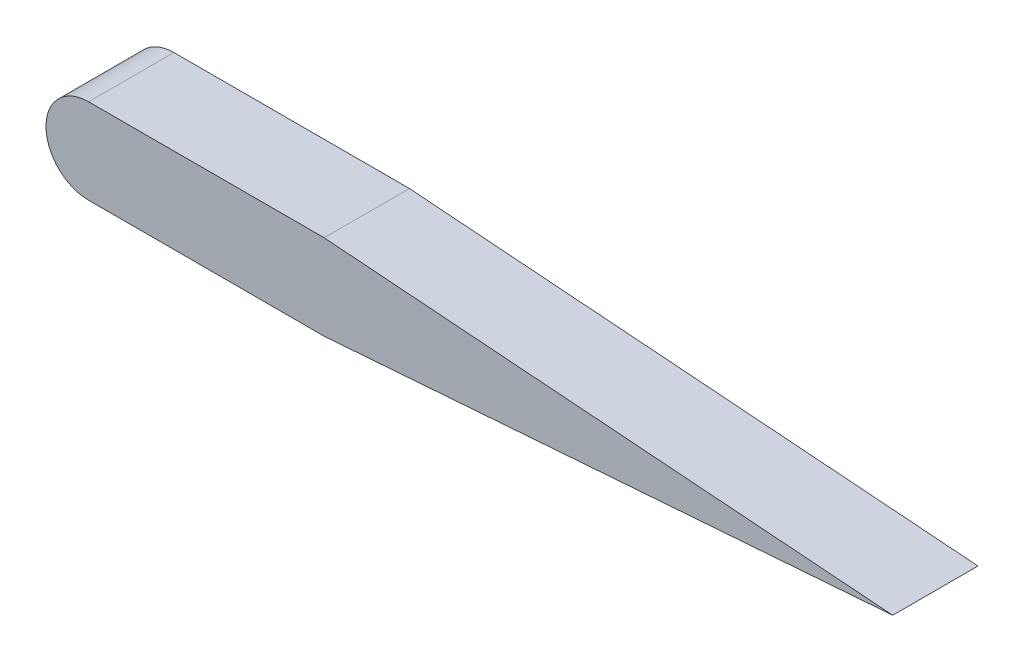
ISO-10303-21;
HEADER;
FILE_DESCRIPTION(('STEP AP214'),'2;1');
FILE_NAME('part.step','',(''),(''),'','','');
FILE_SCHEMA(('AUTOMOTIVE_DESIGN { 1 0 10303 214 1 1 1 1 }'));
ENDSEC;
DATA;
#1=APPLICATION_CONTEXT('core data for automotive mechanical design processes');
#2=APPLICATION_PROTOCOL_DEFINITION('international standard','automotive_design',2000,#1);
#3=PRODUCT_CONTEXT('',#1,'mechanical');
#4=PRODUCT('Part','Part','',(#3));
#5=PRODUCT_RELATED_PRODUCT_CATEGORY('part','',(#4));
#6=PRODUCT_DEFINITION_FORMATION('','',#4);
#7=PRODUCT_DEFINITION_CONTEXT('part definition',#1,'design');
#8=PRODUCT_DEFINITION('design','',#6,#7);
#9=PRODUCT_DEFINITION_SHAPE('','',#8);
#10=(LENGTH_UNIT() NAMED_UNIT(*) SI_UNIT(.MILLI.,.METRE.));
#11=(NAMED_UNIT(*) PLANE_ANGLE_UNIT() SI_UNIT($,.RADIAN.));
#12=(NAMED_UNIT(*) SI_UNIT($,.STERADIAN.) SOLID_ANGLE_UNIT());
#13=UNCERTAINTY_MEASURE_WITH_UNIT(LENGTH_MEASURE(1.E-05),#10,'distance_accuracy_value','');
#14=(GEOMETRIC_REPRESENTATION_CONTEXT(3) GLOBAL_UNCERTAINTY_ASSIGNED_CONTEXT((#13)) GLOBAL_UNIT_ASSIGNED_CONTEXT((#10,
#11,#12)) REPRESENTATION_CONTEXT('',''));
#15=CARTESIAN_POINT('',(0.,0.,0.));
#16=DIRECTION('',(0.,0.,1.));
#17=DIRECTION('',(1.,0.,0.));
#18=AXIS2_PLACEMENT_3D('',#15,#16,#17);
#19=CARTESIAN_POINT('',(0.,1.5875,3.175));
#20=DIRECTION('',(0.,1.,0.));
#21=DIRECTION('',(-1.,0.,0.));
#22=AXIS2_PLACEMENT_3D('',#19,#20,#21);
#23=PLANE('',#22);
#24=DIRECTION('',(1.,0.,0.));
#25=VECTOR('',#24,1.);
#26=CARTESIAN_POINT('',(0.,1.5875,0.));
#27=LINE('',#26,#25);
#28=CARTESIAN_POINT('',(-4.53368130185499,1.5875,0.));
#29=VERTEX_POINT('',#28);
#30=CARTESIAN_POINT('',(4.23333333333331,1.5875,0.));
#31=VERTEX_POINT('',#30);
#32=EDGE_CURVE('E111',#29,#31,#27,.T.);
#33=ORIENTED_EDGE('',*,*,#32,.F.);
#34=DIRECTION('',(0.,0.,-1.));
#35=VECTOR('',#34,1.);
#36=CARTESIAN_POINT('',(-4.53368130185499,1.5875,3.175));
#37=LINE('',#36,#35);
#38=CARTESIAN_POINT('',(-4.53368130185499,1.5875,3.175));
#39=VERTEX_POINT('',#38);
#40=EDGE_CURVE('E11',#39,#29,#37,.T.);
#41=ORIENTED_EDGE('',*,*,#40,.F.);
#42=DIRECTION('',(1.,0.,0.));
#43=VECTOR('',#42,1.);
#44=CARTESIAN_POINT('',(0.,1.5875,3.175));
#45=LINE('',#44,#43);
#46=CARTESIAN_POINT('',(4.23333333333331,1.5875,3.175));
#47=VERTEX_POINT('',#46);
#48=EDGE_CURVE('E121',#39,#47,#45,.T.);
#49=ORIENTED_EDGE('',*,*,#48,.T.);
#50=DIRECTION('',(0.,0.,-1.));
#51=VECTOR('',#50,1.);
#52=CARTESIAN_POINT('',(4.23333333333331,1.5875,3.175));
#53=LINE('',#52,#51);
#54=EDGE_CURVE('E53',#47,#31,#53,.T.);
#55=ORIENTED_EDGE('',*,*,#54,.T.);
#56=EDGE_LOOP('',(#33,#41,#49,#55));
#57=FACE_BOUND('',#56,.T.);
#58=ADVANCED_FACE('F37',(#57),#23,.T.);
#59=CARTESIAN_POINT('',(-4.53368130185499,0.,3.175));
#60=DIRECTION('',(0.,0.,-1.));
#61=DIRECTION('',(-1.,0.,0.));
#62=AXIS2_PLACEMENT_3D('',#59,#60,#61);
#63=CYLINDRICAL_SURFACE('',#62,1.5875);
#64=CARTESIAN_POINT('',(-4.53368130185499,0.,0.));
#65=DIRECTION('',(0.,0.,1.));
#66=DIRECTION('',(1.,0.,0.));
#67=AXIS2_PLACEMENT_3D('',#64,#65,#66);
#68=CIRCLE('',#67,1.5875);
#69=CARTESIAN_POINT('',(-4.53368130185499,-1.5875,0.));
#70=VERTEX_POINT('',#69);
#71=EDGE_CURVE('E113',#29,#70,#68,.T.);
#72=ORIENTED_EDGE('',*,*,#71,.T.);
#73=DIRECTION('',(0.,0.,-1.));
#74=VECTOR('',#73,1.);
#75=CARTESIAN_POINT('',(-4.53368130185499,-1.5875,3.175));
#76=LINE('',#75,#74);
#77=CARTESIAN_POINT('',(-4.53368130185499,-1.5875,3.175));
#78=VERTEX_POINT('',#77);
#79=EDGE_CURVE('E45',#78,#70,#76,.T.);
#80=ORIENTED_EDGE('',*,*,#79,.F.);
#81=CARTESIAN_POINT('',(-4.53368130185499,0.,3.175));
#82=DIRECTION('',(0.,0.,1.));
#83=DIRECTION('',(1.,0.,0.));
#84=AXIS2_PLACEMENT_3D('',#81,#82,#83);
#85=CIRCLE('',#84,1.5875);
#86=EDGE_CURVE('E92',#39,#78,#85,.T.);
#87=ORIENTED_EDGE('',*,*,#86,.F.);
#88=ORIENTED_EDGE('',*,*,#40,.T.);
#89=EDGE_LOOP('',(#72,#80,#87,#88));
#90=FACE_BOUND('',#89,.T.);
#91=ADVANCED_FACE('F138',(#90),#63,.T.);
#92=CARTESIAN_POINT('',(0.,-1.5875,3.175));
#93=DIRECTION('',(0.,1.,0.));
#94=DIRECTION('',(-1.,0.,0.));
#95=AXIS2_PLACEMENT_3D('',#92,#93,#94);
#96=PLANE('',#95);
#97=DIRECTION('',(1.,0.,0.));
#98=VECTOR('',#97,1.);
#99=CARTESIAN_POINT('',(0.,-1.5875,0.));
#100=LINE('',#99,#98);
#101=CARTESIAN_POINT('',(4.23333333333339,-1.5875,0.));
#102=VERTEX_POINT('',#101);
#103=EDGE_CURVE('E101',#70,#102,#100,.T.);
#104=ORIENTED_EDGE('',*,*,#103,.T.);
#105=DIRECTION('',(0.,0.,-1.));
#106=VECTOR('',#105,1.);
#107=CARTESIAN_POINT('',(4.23333333333339,-1.5875,3.175));
#108=LINE('',#107,#106);
#109=CARTESIAN_POINT('',(4.23333333333339,-1.5875,3.175));
#110=VERTEX_POINT('',#109);
#111=EDGE_CURVE('E98',#110,#102,#108,.T.);
#112=ORIENTED_EDGE('',*,*,#111,.F.);
#113=DIRECTION('',(1.,0.,0.));
#114=VECTOR('',#113,1.);
#115=CARTESIAN_POINT('',(0.,-1.5875,3.175));
#116=LINE('',#115,#114);
#117=EDGE_CURVE('E85',#78,#110,#116,.T.);
#118=ORIENTED_EDGE('',*,*,#117,.F.);
#119=ORIENTED_EDGE('',*,*,#79,.T.);
#120=EDGE_LOOP('',(#104,#112,#118,#119));
#121=FACE_BOUND('',#120,.T.);
#122=ADVANCED_FACE('F99',(#121),#96,.F.);
#123=CARTESIAN_POINT('',(0.142075823492869,-1.89434431323807,3.175));
#124=DIRECTION('',(-0.0747899482416417,0.997199309888456,0.));
#125=DIRECTION('',(-0.997199309888456,-0.0747899482416417,0.));
#126=AXIS2_PLACEMENT_3D('',#123,#124,#125);
#127=PLANE('',#126);
#128=DIRECTION('',(0.997199309888456,0.0747899482416417,0.));
#129=VECTOR('',#128,1.);
#130=CARTESIAN_POINT('',(0.142075823492869,-1.89434431323807,0.));
#131=LINE('',#130,#129);
#132=CARTESIAN_POINT('',(25.4,1.56992474575901E-13,0.));
#133=VERTEX_POINT('',#132);
#134=EDGE_CURVE('E116',#102,#133,#131,.T.);
#135=ORIENTED_EDGE('',*,*,#134,.T.);
#136=DIRECTION('',(0.,0.,-1.));
#137=VECTOR('',#136,1.);
#138=CARTESIAN_POINT('',(25.4,1.56992474575901E-13,3.175));
#139=LINE('',#138,#137);
#140=CARTESIAN_POINT('',(25.4,1.56992474575901E-13,3.175));
#141=VERTEX_POINT('',#140);
#142=EDGE_CURVE('E70',#141,#133,#139,.T.);
#143=ORIENTED_EDGE('',*,*,#142,.F.);
#144=DIRECTION('',(0.997199309888456,0.0747899482416417,0.));
#145=VECTOR('',#144,1.);
#146=CARTESIAN_POINT('',(0.142075823492869,-1.89434431323807,3.175));
#147=LINE('',#146,#145);
#148=EDGE_CURVE('E91',#110,#141,#147,.T.);
#149=ORIENTED_EDGE('',*,*,#148,.F.);
#150=ORIENTED_EDGE('',*,*,#111,.T.);
#151=EDGE_LOOP('',(#135,#143,#149,#150));
#152=FACE_BOUND('',#151,.T.);
#153=ADVANCED_FACE('F105',(#152),#127,.F.);
#154=CARTESIAN_POINT('',(0.142075823492836,1.894344313238,3.175));
#155=DIRECTION('',(0.0747899482416267,0.997199309888457,0.));
#156=DIRECTION('',(-0.997199309888457,0.0747899482416267,0.));
#157=AXIS2_PLACEMENT_3D('',#154,#155,#156);
#158=PLANE('',#157);
#159=DIRECTION('',(0.997199309888457,-0.0747899482416267,0.));
#160=VECTOR('',#159,1.);
#161=CARTESIAN_POINT('',(0.142075823492836,1.894344313238,0.));
#162=LINE('',#161,#160);
#163=EDGE_CURVE('E118',#31,#133,#162,.T.);
#164=ORIENTED_EDGE('',*,*,#163,.F.);
#165=ORIENTED_EDGE('',*,*,#54,.F.);
#166=DIRECTION('',(0.997199309888457,-0.0747899482416267,0.));
#167=VECTOR('',#166,1.);
#168=CARTESIAN_POINT('',(0.142075823492836,1.894344313238,3.175));
#169=LINE('',#168,#167);
#170=EDGE_CURVE('E106',#47,#141,#169,.T.);
#171=ORIENTED_EDGE('',*,*,#170,.T.);
#172=ORIENTED_EDGE('',*,*,#142,.T.);
#173=EDGE_LOOP('',(#164,#165,#171,#172));
#174=FACE_BOUND('',#173,.T.);
#175=ADVANCED_FACE('F127',(#174),#158,.T.);
#176=CARTESIAN_POINT('',(0.,0.,3.175));
#177=DIRECTION('',(0.,0.,1.));
#178=DIRECTION('',(1.,0.,0.));
#179=AXIS2_PLACEMENT_3D('',#176,#177,#178);
#180=PLANE('',#179);
#181=ORIENTED_EDGE('',*,*,#48,.F.);
#182=ORIENTED_EDGE('',*,*,#86,.T.);
#183=ORIENTED_EDGE('',*,*,#117,.T.);
#184=ORIENTED_EDGE('',*,*,#148,.T.);
#185=ORIENTED_EDGE('',*,*,#170,.F.);
#186=EDGE_LOOP('',(#181,#182,#183,#184,#185));
#187=FACE_BOUND('',#186,.T.);
#188=ADVANCED_FACE('F88',(#187),#180,.T.);
#189=CARTESIAN_POINT('',(0.,0.,0.));
#190=DIRECTION('',(0.,0.,1.));
#191=DIRECTION('',(1.,0.,0.));
#192=AXIS2_PLACEMENT_3D('',#189,#190,#191);
#193=PLANE('',#192);
#194=ORIENTED_EDGE('',*,*,#32,.T.);
#195=ORIENTED_EDGE('',*,*,#163,.T.);
#196=ORIENTED_EDGE('',*,*,#134,.F.);
#197=ORIENTED_EDGE('',*,*,#103,.F.);
#198=ORIENTED_EDGE('',*,*,#71,.F.);
#199=EDGE_LOOP('',(#194,#195,#196,#197,#198));
#200=FACE_BOUND('',#199,.T.);
#201=ADVANCED_FACE('F126',(#200),#193,.F.);
#202=CLOSED_SHELL('',(#58,#91,#122,#153,#175,#188,#201));
#203=MANIFOLD_SOLID_BREP('B2',#202);
#204=ADVANCED_BREP_SHAPE_REPRESENTATION('',(#18,#203),#14);
#205=SHAPE_DEFINITION_REPRESENTATION(#9,#204);
ENDSEC;
END-ISO-10303-21;
